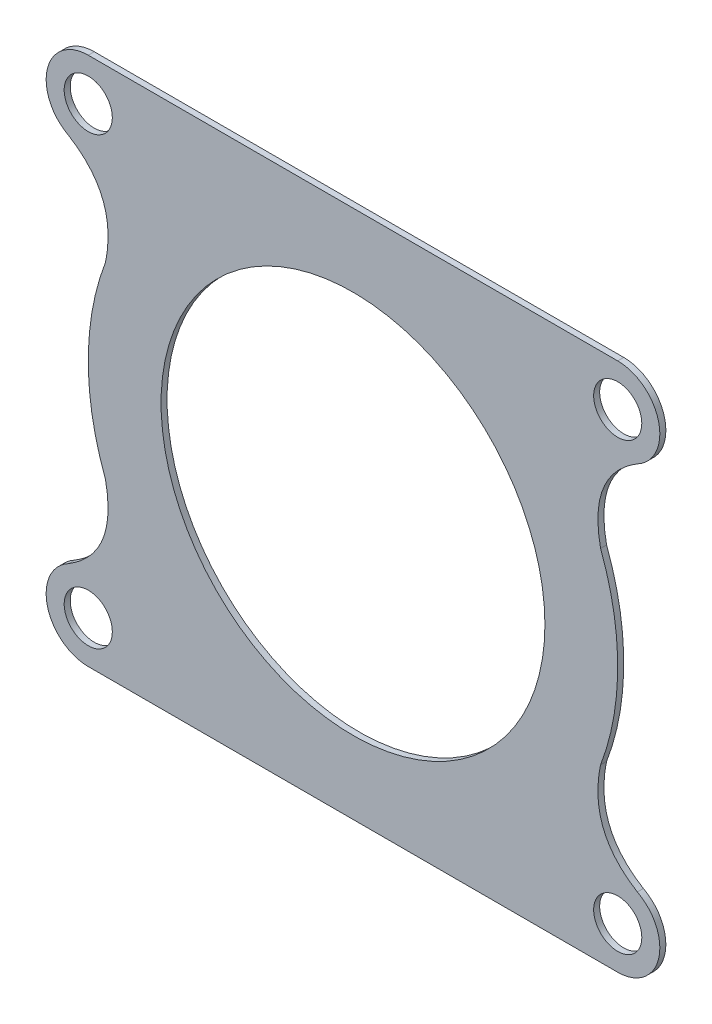
ISO-10303-21;
HEADER;
FILE_DESCRIPTION(('STEP AP214'),'2;1');
FILE_NAME('part.step','',(''),(''),'','','');
FILE_SCHEMA(('AUTOMOTIVE_DESIGN { 1 0 10303 214 1 1 1 1 }'));
ENDSEC;
DATA;
#1=APPLICATION_CONTEXT('core data for automotive mechanical design processes');
#2=APPLICATION_PROTOCOL_DEFINITION('international standard','automotive_design',2000,#1);
#3=PRODUCT_CONTEXT('',#1,'mechanical');
#4=PRODUCT('Part','Part','',(#3));
#5=PRODUCT_RELATED_PRODUCT_CATEGORY('part','',(#4));
#6=PRODUCT_DEFINITION_FORMATION('','',#4);
#7=PRODUCT_DEFINITION_CONTEXT('part definition',#1,'design');
#8=PRODUCT_DEFINITION('design','',#6,#7);
#9=PRODUCT_DEFINITION_SHAPE('','',#8);
#10=(LENGTH_UNIT() NAMED_UNIT(*) SI_UNIT(.MILLI.,.METRE.));
#11=(NAMED_UNIT(*) PLANE_ANGLE_UNIT() SI_UNIT($,.RADIAN.));
#12=(NAMED_UNIT(*) SI_UNIT($,.STERADIAN.) SOLID_ANGLE_UNIT());
#13=UNCERTAINTY_MEASURE_WITH_UNIT(LENGTH_MEASURE(1.E-05),#10,'distance_accuracy_value','');
#14=(GEOMETRIC_REPRESENTATION_CONTEXT(3) GLOBAL_UNCERTAINTY_ASSIGNED_CONTEXT((#13)) GLOBAL_UNIT_ASSIGNED_CONTEXT((#10,
#11,#12)) REPRESENTATION_CONTEXT('',''));
#15=CARTESIAN_POINT('',(0.,0.,0.));
#16=DIRECTION('',(0.,0.,1.));
#17=DIRECTION('',(1.,0.,0.));
#18=AXIS2_PLACEMENT_3D('',#15,#16,#17);
#19=CARTESIAN_POINT('',(-10.9904908296099,9.65088660433989,0.25));
#20=DIRECTION('',(0.,0.,1.));
#21=DIRECTION('',(1.,0.,0.));
#22=AXIS2_PLACEMENT_3D('',#19,#20,#21);
#23=PLANE('',#22);
#24=CARTESIAN_POINT('',(-10.9904908296099,-8.84911339566011,0.25));
#25=DIRECTION('',(0.,0.,1.));
#26=DIRECTION('',(1.,0.,0.));
#27=AXIS2_PLACEMENT_3D('',#24,#25,#26);
#28=CIRCLE('',#27,0.999999999999998);
#29=CARTESIAN_POINT('',(-9.9904908296099,-8.84911339566011,0.25));
#30=VERTEX_POINT('',#29);
#31=EDGE_CURVE('E513',#30,#30,#28,.T.);
#32=ORIENTED_EDGE('',*,*,#31,.F.);
#33=EDGE_LOOP('',(#32));
#34=FACE_BOUND('',#33,.T.);
#35=CARTESIAN_POINT('',(-10.9904908296099,9.65088660433989,0.25));
#36=DIRECTION('',(0.,0.,1.));
#37=DIRECTION('',(1.,0.,0.));
#38=AXIS2_PLACEMENT_3D('',#35,#36,#37);
#39=CIRCLE('',#38,1.);
#40=CARTESIAN_POINT('',(-9.9904908296099,9.65088660433989,0.25));
#41=VERTEX_POINT('',#40);
#42=EDGE_CURVE('E529',#41,#41,#39,.T.);
#43=ORIENTED_EDGE('',*,*,#42,.F.);
#44=EDGE_LOOP('',(#43));
#45=FACE_BOUND('',#44,.T.);
#46=CARTESIAN_POINT('',(-10.9904908296099,9.65088660433989,0.25));
#47=DIRECTION('',(0.,0.,1.));
#48=DIRECTION('',(1.,0.,0.));
#49=AXIS2_PLACEMENT_3D('',#46,#47,#48);
#50=CIRCLE('',#49,1.74999999999999);
#51=CARTESIAN_POINT('',(-10.9904908296099,11.4008866043399,0.25));
#52=VERTEX_POINT('',#51);
#53=CARTESIAN_POINT('',(-11.8060120475557,8.10252452029781,0.25));
#54=VERTEX_POINT('',#53);
#55=EDGE_CURVE('E223',#52,#54,#50,.T.);
#56=ORIENTED_EDGE('',*,*,#55,.T.);
#57=CARTESIAN_POINT('',(-896790.722122131,-442475.992951984,0.25));
#58=CARTESIAN_POINT('',(895703.111632128,444638.210990145,0.25));
#59=CARTESIAN_POINT('',(-894657.439231659,-446773.508022814,0.25));
#60=B_SPLINE_CURVE_WITH_KNOTS('',2,(#57,#58,#59),.UNSPECIFIED.,.F.,.F.,(3,3),(0.,1.),.UNSPECIFIED.);
#61=CARTESIAN_POINT('',(-10.2779050945684,4.29564047940197,0.25));
#62=VERTEX_POINT('',#61);
#63=EDGE_CURVE('E112',#54,#62,#60,.T.);
#64=ORIENTED_EDGE('',*,*,#63,.T.);
#65=CARTESIAN_POINT('',(0.00950917039010263,0.40088660433989,0.25));
#66=DIRECTION('',(0.,0.,1.));
#67=DIRECTION('',(1.,0.,0.));
#68=AXIS2_PLACEMENT_3D('',#65,#66,#67);
#69=CIRCLE('',#68,11.000000000281);
#70=CARTESIAN_POINT('',(-10.2779051012596,-3.49386724047607,0.25));
#71=VERTEX_POINT('',#70);
#72=EDGE_CURVE('E260',#62,#71,#69,.T.);
#73=ORIENTED_EDGE('',*,*,#72,.T.);
#74=CARTESIAN_POINT('',(-894657.439231684,446774.309795972,0.25));
#75=CARTESIAN_POINT('',(895703.11163213,-444637.409216931,0.25));
#76=CARTESIAN_POINT('',(-896790.722122111,442476.794725234,0.25));
#77=B_SPLINE_CURVE_WITH_KNOTS('',2,(#74,#75,#76),.UNSPECIFIED.,.F.,.F.,(3,3),(0.,1.),.UNSPECIFIED.);
#78=CARTESIAN_POINT('',(-11.8060120482112,-7.30075131204549,0.25));
#79=VERTEX_POINT('',#78);
#80=EDGE_CURVE('E280',#71,#79,#77,.T.);
#81=ORIENTED_EDGE('',*,*,#80,.T.);
#82=CARTESIAN_POINT('',(-10.9904908296099,-8.84911339566011,0.25));
#83=DIRECTION('',(0.,0.,1.));
#84=DIRECTION('',(1.,0.,0.));
#85=AXIS2_PLACEMENT_3D('',#82,#83,#84);
#86=CIRCLE('',#85,1.74999999998982);
#87=CARTESIAN_POINT('',(-10.9904908296099,-10.5991133956601,0.25));
#88=VERTEX_POINT('',#87);
#89=EDGE_CURVE('E276',#79,#88,#86,.T.);
#90=ORIENTED_EDGE('',*,*,#89,.T.);
#91=DIRECTION('',(1.,0.,0.));
#92=VECTOR('',#91,1.);
#93=CARTESIAN_POINT('',(-10.9904908296099,-10.5991133956601,0.25));
#94=LINE('',#93,#92);
#95=CARTESIAN_POINT('',(11.0095091703901,-10.5991133956601,0.25));
#96=VERTEX_POINT('',#95);
#97=EDGE_CURVE('E279',#88,#96,#94,.T.);
#98=ORIENTED_EDGE('',*,*,#97,.T.);
#99=CARTESIAN_POINT('',(11.0095091703901,-8.84911339566011,0.25));
#100=DIRECTION('',(0.,0.,1.));
#101=DIRECTION('',(1.,0.,0.));
#102=AXIS2_PLACEMENT_3D('',#99,#100,#101);
#103=CIRCLE('',#102,1.75);
#104=CARTESIAN_POINT('',(11.8250303883312,-7.30075131163249,0.25));
#105=VERTEX_POINT('',#104);
#106=EDGE_CURVE('E284',#96,#105,#103,.T.);
#107=ORIENTED_EDGE('',*,*,#106,.T.);
#108=CARTESIAN_POINT('',(896790.741140472,442476.794725193,0.25));
#109=CARTESIAN_POINT('',(-895703.092613789,-444637.409216932,0.25));
#110=CARTESIAN_POINT('',(894657.458250003,446774.309796016,0.25));
#111=B_SPLINE_CURVE_WITH_KNOTS('',2,(#108,#109,#110),.UNSPECIFIED.,.F.,.F.,(3,3),(0.,1.),.UNSPECIFIED.);
#112=CARTESIAN_POINT('',(10.296923435311,-3.49386727070898,0.25));
#113=VERTEX_POINT('',#112);
#114=EDGE_CURVE('E294',#105,#113,#111,.T.);
#115=ORIENTED_EDGE('',*,*,#114,.T.);
#116=CARTESIAN_POINT('',(0.00950917039010263,0.40088660433989,0.25));
#117=DIRECTION('',(0.,0.,1.));
#118=DIRECTION('',(1.,0.,0.));
#119=AXIS2_PLACEMENT_3D('',#116,#117,#118);
#120=CIRCLE('',#119,11.0000000002412);
#121=CARTESIAN_POINT('',(10.296923441853,4.29564044909903,0.25));
#122=VERTEX_POINT('',#121);
#123=EDGE_CURVE('E143',#113,#122,#120,.T.);
#124=ORIENTED_EDGE('',*,*,#123,.T.);
#125=CARTESIAN_POINT('',(894657.458250017,-446773.508022779,0.25));
#126=CARTESIAN_POINT('',(-895703.092613789,444638.210990142,0.25));
#127=CARTESIAN_POINT('',(896790.741140457,-442475.992952015,0.25));
#128=B_SPLINE_CURVE_WITH_KNOTS('',2,(#125,#126,#127),.UNSPECIFIED.,.F.,.F.,(3,3),(0.,1.),.UNSPECIFIED.);
#129=CARTESIAN_POINT('',(11.825030388974,8.10252452071291,0.25));
#130=VERTEX_POINT('',#129);
#131=EDGE_CURVE('E137',#122,#130,#128,.T.);
#132=ORIENTED_EDGE('',*,*,#131,.T.);
#133=CARTESIAN_POINT('',(11.0095091703901,9.65088660433989,0.25));
#134=DIRECTION('',(0.,0.,1.));
#135=DIRECTION('',(1.,0.,0.));
#136=AXIS2_PLACEMENT_3D('',#133,#134,#135);
#137=CIRCLE('',#136,1.74999999999266);
#138=CARTESIAN_POINT('',(11.0095091703901,11.4008866043399,0.25));
#139=VERTEX_POINT('',#138);
#140=EDGE_CURVE('E141',#130,#139,#137,.T.);
#141=ORIENTED_EDGE('',*,*,#140,.T.);
#142=DIRECTION('',(-1.,0.,0.));
#143=VECTOR('',#142,1.);
#144=CARTESIAN_POINT('',(11.0095091703901,11.4008866043399,0.25));
#145=LINE('',#144,#143);
#146=EDGE_CURVE('E57',#139,#52,#145,.T.);
#147=ORIENTED_EDGE('',*,*,#146,.T.);
#148=EDGE_LOOP('',(#56,#64,#73,#81,#90,#98,#107,#115,#124,#132,#141,#147));
#149=FACE_BOUND('',#148,.T.);
#150=CARTESIAN_POINT('',(11.0095091703901,9.65088660433989,0.25));
#151=DIRECTION('',(0.,0.,1.));
#152=DIRECTION('',(1.,0.,0.));
#153=AXIS2_PLACEMENT_3D('',#150,#151,#152);
#154=CIRCLE('',#153,1.);
#155=CARTESIAN_POINT('',(12.0095091703901,9.65088660433989,0.25));
#156=VERTEX_POINT('',#155);
#157=EDGE_CURVE('E173',#156,#156,#154,.T.);
#158=ORIENTED_EDGE('',*,*,#157,.F.);
#159=EDGE_LOOP('',(#158));
#160=FACE_BOUND('',#159,.T.);
#161=CARTESIAN_POINT('',(11.0095091703901,-8.84911339566011,0.25));
#162=DIRECTION('',(0.,0.,1.));
#163=DIRECTION('',(1.,0.,0.));
#164=AXIS2_PLACEMENT_3D('',#161,#162,#163);
#165=CIRCLE('',#164,0.999999999999999);
#166=CARTESIAN_POINT('',(12.0095091703901,-8.84911339566011,0.25));
#167=VERTEX_POINT('',#166);
#168=EDGE_CURVE('E521',#167,#167,#165,.T.);
#169=ORIENTED_EDGE('',*,*,#168,.F.);
#170=EDGE_LOOP('',(#169));
#171=FACE_BOUND('',#170,.T.);
#172=CARTESIAN_POINT('',(0.00950917039010263,0.40088660433989,0.25));
#173=DIRECTION('',(0.,0.,1.));
#174=DIRECTION('',(1.,0.,0.));
#175=AXIS2_PLACEMENT_3D('',#172,#173,#174);
#176=CIRCLE('',#175,7.975);
#177=CARTESIAN_POINT('',(7.9845091703901,0.40088660433989,0.25));
#178=VERTEX_POINT('',#177);
#179=EDGE_CURVE('E502',#178,#178,#176,.T.);
#180=ORIENTED_EDGE('',*,*,#179,.F.);
#181=EDGE_LOOP('',(#180));
#182=FACE_BOUND('',#181,.T.);
#183=ADVANCED_FACE('F39',(#34,#45,#149,#160,#171,#182),#23,.T.);
#184=CARTESIAN_POINT('',(-10.9904908296099,9.65088660433989,0.));
#185=DIRECTION('',(0.,0.,1.));
#186=DIRECTION('',(1.,0.,0.));
#187=AXIS2_PLACEMENT_3D('',#184,#185,#186);
#188=PLANE('',#187);
#189=CARTESIAN_POINT('',(-10.9904908296099,9.65088660433989,0.));
#190=DIRECTION('',(0.,0.,1.));
#191=DIRECTION('',(1.,0.,0.));
#192=AXIS2_PLACEMENT_3D('',#189,#190,#191);
#193=CIRCLE('',#192,1.74999999999999);
#194=CARTESIAN_POINT('',(-10.9904908296099,11.4008866043399,0.));
#195=VERTEX_POINT('',#194);
#196=CARTESIAN_POINT('',(-11.8060120475557,8.10252452029781,0.));
#197=VERTEX_POINT('',#196);
#198=EDGE_CURVE('E168',#195,#197,#193,.T.);
#199=ORIENTED_EDGE('',*,*,#198,.F.);
#200=DIRECTION('',(-1.,0.,0.));
#201=VECTOR('',#200,1.);
#202=CARTESIAN_POINT('',(11.0095091703901,11.4008866043399,0.));
#203=LINE('',#202,#201);
#204=CARTESIAN_POINT('',(11.0095091703901,11.4008866043399,0.));
#205=VERTEX_POINT('',#204);
#206=EDGE_CURVE('E104',#205,#195,#203,.T.);
#207=ORIENTED_EDGE('',*,*,#206,.F.);
#208=CARTESIAN_POINT('',(11.0095091703901,9.65088660433989,0.));
#209=DIRECTION('',(0.,0.,1.));
#210=DIRECTION('',(1.,0.,0.));
#211=AXIS2_PLACEMENT_3D('',#208,#209,#210);
#212=CIRCLE('',#211,1.74999999999266);
#213=CARTESIAN_POINT('',(11.825030388974,8.10252452071291,0.));
#214=VERTEX_POINT('',#213);
#215=EDGE_CURVE('E98',#214,#205,#212,.T.);
#216=ORIENTED_EDGE('',*,*,#215,.F.);
#217=CARTESIAN_POINT('',(894657.458250017,-446773.508022779,0.));
#218=CARTESIAN_POINT('',(-895703.092613789,444638.210990142,0.));
#219=CARTESIAN_POINT('',(896790.741140457,-442475.992952015,0.));
#220=B_SPLINE_CURVE_WITH_KNOTS('',2,(#217,#218,#219),.UNSPECIFIED.,.F.,.F.,(3,3),(0.,1.),.UNSPECIFIED.);
#221=CARTESIAN_POINT('',(10.296923441853,4.29564044909903,0.));
#222=VERTEX_POINT('',#221);
#223=EDGE_CURVE('E152',#222,#214,#220,.T.);
#224=ORIENTED_EDGE('',*,*,#223,.F.);
#225=CARTESIAN_POINT('',(0.00950917039010263,0.40088660433989,0.));
#226=DIRECTION('',(0.,0.,1.));
#227=DIRECTION('',(1.,0.,0.));
#228=AXIS2_PLACEMENT_3D('',#225,#226,#227);
#229=CIRCLE('',#228,11.0000000002412);
#230=CARTESIAN_POINT('',(10.296923435311,-3.49386727070898,0.));
#231=VERTEX_POINT('',#230);
#232=EDGE_CURVE('E206',#231,#222,#229,.T.);
#233=ORIENTED_EDGE('',*,*,#232,.F.);
#234=CARTESIAN_POINT('',(896790.741140472,442476.794725193,0.));
#235=CARTESIAN_POINT('',(-895703.092613789,-444637.409216932,0.));
#236=CARTESIAN_POINT('',(894657.458250003,446774.309796016,0.));
#237=B_SPLINE_CURVE_WITH_KNOTS('',2,(#234,#235,#236),.UNSPECIFIED.,.F.,.F.,(3,3),(0.,1.),.UNSPECIFIED.);
#238=CARTESIAN_POINT('',(11.8250303883312,-7.30075131163249,0.));
#239=VERTEX_POINT('',#238);
#240=EDGE_CURVE('E201',#239,#231,#237,.T.);
#241=ORIENTED_EDGE('',*,*,#240,.F.);
#242=CARTESIAN_POINT('',(11.0095091703901,-8.84911339566011,0.));
#243=DIRECTION('',(0.,0.,1.));
#244=DIRECTION('',(1.,0.,0.));
#245=AXIS2_PLACEMENT_3D('',#242,#243,#244);
#246=CIRCLE('',#245,1.75);
#247=CARTESIAN_POINT('',(11.0095091703901,-10.5991133956601,0.));
#248=VERTEX_POINT('',#247);
#249=EDGE_CURVE('E198',#248,#239,#246,.T.);
#250=ORIENTED_EDGE('',*,*,#249,.F.);
#251=DIRECTION('',(1.,0.,0.));
#252=VECTOR('',#251,1.);
#253=CARTESIAN_POINT('',(-10.9904908296099,-10.5991133956601,0.));
#254=LINE('',#253,#252);
#255=CARTESIAN_POINT('',(-10.9904908296099,-10.5991133956601,0.));
#256=VERTEX_POINT('',#255);
#257=EDGE_CURVE('E195',#256,#248,#254,.T.);
#258=ORIENTED_EDGE('',*,*,#257,.F.);
#259=CARTESIAN_POINT('',(-10.9904908296099,-8.84911339566011,0.));
#260=DIRECTION('',(0.,0.,1.));
#261=DIRECTION('',(1.,0.,0.));
#262=AXIS2_PLACEMENT_3D('',#259,#260,#261);
#263=CIRCLE('',#262,1.74999999998982);
#264=CARTESIAN_POINT('',(-11.8060120482112,-7.30075131204549,0.));
#265=VERTEX_POINT('',#264);
#266=EDGE_CURVE('E189',#265,#256,#263,.T.);
#267=ORIENTED_EDGE('',*,*,#266,.F.);
#268=CARTESIAN_POINT('',(-894657.439231684,446774.309795972,0.));
#269=CARTESIAN_POINT('',(895703.11163213,-444637.409216931,0.));
#270=CARTESIAN_POINT('',(-896790.722122111,442476.794725234,0.));
#271=B_SPLINE_CURVE_WITH_KNOTS('',2,(#268,#269,#270),.UNSPECIFIED.,.F.,.F.,(3,3),(0.,1.),.UNSPECIFIED.);
#272=CARTESIAN_POINT('',(-10.2779051012596,-3.49386724047607,0.));
#273=VERTEX_POINT('',#272);
#274=EDGE_CURVE('E184',#273,#265,#271,.T.);
#275=ORIENTED_EDGE('',*,*,#274,.F.);
#276=CARTESIAN_POINT('',(0.00950917039010263,0.40088660433989,0.));
#277=DIRECTION('',(0.,0.,1.));
#278=DIRECTION('',(1.,0.,0.));
#279=AXIS2_PLACEMENT_3D('',#276,#277,#278);
#280=CIRCLE('',#279,11.000000000281);
#281=CARTESIAN_POINT('',(-10.2779050945684,4.29564047940197,0.));
#282=VERTEX_POINT('',#281);
#283=EDGE_CURVE('E178',#282,#273,#280,.T.);
#284=ORIENTED_EDGE('',*,*,#283,.F.);
#285=CARTESIAN_POINT('',(-896790.722122131,-442475.992951984,0.));
#286=CARTESIAN_POINT('',(895703.111632128,444638.210990145,0.));
#287=CARTESIAN_POINT('',(-894657.439231659,-446773.508022814,0.));
#288=B_SPLINE_CURVE_WITH_KNOTS('',2,(#285,#286,#287),.UNSPECIFIED.,.F.,.F.,(3,3),(0.,1.),.UNSPECIFIED.);
#289=EDGE_CURVE('E172',#197,#282,#288,.T.);
#290=ORIENTED_EDGE('',*,*,#289,.F.);
#291=EDGE_LOOP('',(#199,#207,#216,#224,#233,#241,#250,#258,#267,#275,#284,#290));
#292=FACE_BOUND('',#291,.T.);
#293=CARTESIAN_POINT('',(11.0095091703901,9.65088660433989,0.));
#294=DIRECTION('',(0.,0.,1.));
#295=DIRECTION('',(1.,0.,0.));
#296=AXIS2_PLACEMENT_3D('',#293,#294,#295);
#297=CIRCLE('',#296,1.);
#298=CARTESIAN_POINT('',(12.0095091703901,9.65088660433989,0.));
#299=VERTEX_POINT('',#298);
#300=EDGE_CURVE('E533',#299,#299,#297,.T.);
#301=ORIENTED_EDGE('',*,*,#300,.T.);
#302=EDGE_LOOP('',(#301));
#303=FACE_BOUND('',#302,.T.);
#304=CARTESIAN_POINT('',(-10.9904908296099,9.65088660433989,0.));
#305=DIRECTION('',(0.,0.,1.));
#306=DIRECTION('',(1.,0.,0.));
#307=AXIS2_PLACEMENT_3D('',#304,#305,#306);
#308=CIRCLE('',#307,1.);
#309=CARTESIAN_POINT('',(-9.9904908296099,9.65088660433989,0.));
#310=VERTEX_POINT('',#309);
#311=EDGE_CURVE('E525',#310,#310,#308,.T.);
#312=ORIENTED_EDGE('',*,*,#311,.T.);
#313=EDGE_LOOP('',(#312));
#314=FACE_BOUND('',#313,.T.);
#315=CARTESIAN_POINT('',(11.0095091703901,-8.84911339566011,0.));
#316=DIRECTION('',(0.,0.,1.));
#317=DIRECTION('',(1.,0.,0.));
#318=AXIS2_PLACEMENT_3D('',#315,#316,#317);
#319=CIRCLE('',#318,0.999999999999999);
#320=CARTESIAN_POINT('',(12.0095091703901,-8.84911339566011,0.));
#321=VERTEX_POINT('',#320);
#322=EDGE_CURVE('E517',#321,#321,#319,.T.);
#323=ORIENTED_EDGE('',*,*,#322,.T.);
#324=EDGE_LOOP('',(#323));
#325=FACE_BOUND('',#324,.T.);
#326=CARTESIAN_POINT('',(-10.9904908296099,-8.84911339566011,0.));
#327=DIRECTION('',(0.,0.,1.));
#328=DIRECTION('',(1.,0.,0.));
#329=AXIS2_PLACEMENT_3D('',#326,#327,#328);
#330=CIRCLE('',#329,0.999999999999998);
#331=CARTESIAN_POINT('',(-9.9904908296099,-8.84911339566011,0.));
#332=VERTEX_POINT('',#331);
#333=EDGE_CURVE('E510',#332,#332,#330,.T.);
#334=ORIENTED_EDGE('',*,*,#333,.T.);
#335=EDGE_LOOP('',(#334));
#336=FACE_BOUND('',#335,.T.);
#337=CARTESIAN_POINT('',(0.00950917039010263,0.40088660433989,0.));
#338=DIRECTION('',(0.,0.,1.));
#339=DIRECTION('',(1.,0.,0.));
#340=AXIS2_PLACEMENT_3D('',#337,#338,#339);
#341=CIRCLE('',#340,7.975);
#342=CARTESIAN_POINT('',(7.9845091703901,0.40088660433989,0.));
#343=VERTEX_POINT('',#342);
#344=EDGE_CURVE('E505',#343,#343,#341,.T.);
#345=ORIENTED_EDGE('',*,*,#344,.T.);
#346=EDGE_LOOP('',(#345));
#347=FACE_BOUND('',#346,.T.);
#348=ADVANCED_FACE('F264',(#292,#303,#314,#325,#336,#347),#188,.F.);
#349=CARTESIAN_POINT('',(-10.9904908296099,9.65088660433989,0.25));
#350=DIRECTION('',(0.,0.,-1.));
#351=DIRECTION('',(-1.,0.,0.));
#352=AXIS2_PLACEMENT_3D('',#349,#350,#351);
#353=CYLINDRICAL_SURFACE('',#352,1.74999999999999);
#354=ORIENTED_EDGE('',*,*,#198,.T.);
#355=DIRECTION('',(0.,0.,-1.));
#356=VECTOR('',#355,1.);
#357=CARTESIAN_POINT('',(-11.8060120475557,8.10252452029781,0.25));
#358=LINE('',#357,#356);
#359=EDGE_CURVE('E11',#54,#197,#358,.T.);
#360=ORIENTED_EDGE('',*,*,#359,.F.);
#361=ORIENTED_EDGE('',*,*,#55,.F.);
#362=DIRECTION('',(0.,0.,-1.));
#363=VECTOR('',#362,1.);
#364=CARTESIAN_POINT('',(-10.9904908296099,11.4008866043399,0.25));
#365=LINE('',#364,#363);
#366=EDGE_CURVE('E161',#52,#195,#365,.T.);
#367=ORIENTED_EDGE('',*,*,#366,.T.);
#368=EDGE_LOOP('',(#354,#360,#361,#367));
#369=FACE_BOUND('',#368,.T.);
#370=ADVANCED_FACE('F41',(#369),#353,.T.);
#371=DIRECTION('',(0.,0.,-1.));
#372=VECTOR('',#371,1.);
#373=SURFACE_OF_LINEAR_EXTRUSION('',#60,#372);
#374=ORIENTED_EDGE('',*,*,#289,.T.);
#375=DIRECTION('',(0.,0.,-1.));
#376=VECTOR('',#375,1.);
#377=CARTESIAN_POINT('',(-10.2779050945684,4.29564047940197,0.25));
#378=LINE('',#377,#376);
#379=EDGE_CURVE('E49',#62,#282,#378,.T.);
#380=ORIENTED_EDGE('',*,*,#379,.F.);
#381=ORIENTED_EDGE('',*,*,#63,.F.);
#382=ORIENTED_EDGE('',*,*,#359,.T.);
#383=EDGE_LOOP('',(#374,#380,#381,#382));
#384=FACE_BOUND('',#383,.T.);
#385=ADVANCED_FACE('F323',(#384),#373,.F.);
#386=CARTESIAN_POINT('',(0.00950917039010263,0.40088660433989,0.25));
#387=DIRECTION('',(0.,0.,-1.));
#388=DIRECTION('',(-1.,0.,0.));
#389=AXIS2_PLACEMENT_3D('',#386,#387,#388);
#390=CYLINDRICAL_SURFACE('',#389,11.000000000281);
#391=ORIENTED_EDGE('',*,*,#283,.T.);
#392=DIRECTION('',(0.,0.,-1.));
#393=VECTOR('',#392,1.);
#394=CARTESIAN_POINT('',(-10.2779051012596,-3.49386724047607,0.25));
#395=LINE('',#394,#393);
#396=EDGE_CURVE('E250',#71,#273,#395,.T.);
#397=ORIENTED_EDGE('',*,*,#396,.F.);
#398=ORIENTED_EDGE('',*,*,#72,.F.);
#399=ORIENTED_EDGE('',*,*,#379,.T.);
#400=EDGE_LOOP('',(#391,#397,#398,#399));
#401=FACE_BOUND('',#400,.T.);
#402=ADVANCED_FACE('F258',(#401),#390,.T.);
#403=DIRECTION('',(0.,0.,-1.));
#404=VECTOR('',#403,1.);
#405=SURFACE_OF_LINEAR_EXTRUSION('',#77,#404);
#406=ORIENTED_EDGE('',*,*,#274,.T.);
#407=DIRECTION('',(0.,0.,-1.));
#408=VECTOR('',#407,1.);
#409=CARTESIAN_POINT('',(-11.8060120482112,-7.30075131204549,0.25));
#410=LINE('',#409,#408);
#411=EDGE_CURVE('E246',#79,#265,#410,.T.);
#412=ORIENTED_EDGE('',*,*,#411,.F.);
#413=ORIENTED_EDGE('',*,*,#80,.F.);
#414=ORIENTED_EDGE('',*,*,#396,.T.);
#415=EDGE_LOOP('',(#406,#412,#413,#414));
#416=FACE_BOUND('',#415,.T.);
#417=ADVANCED_FACE('F270',(#416),#405,.F.);
#418=CARTESIAN_POINT('',(-10.9904908296099,-8.84911339566011,0.25));
#419=DIRECTION('',(0.,0.,-1.));
#420=DIRECTION('',(-1.,0.,0.));
#421=AXIS2_PLACEMENT_3D('',#418,#419,#420);
#422=CYLINDRICAL_SURFACE('',#421,1.74999999998982);
#423=ORIENTED_EDGE('',*,*,#266,.T.);
#424=DIRECTION('',(0.,0.,-1.));
#425=VECTOR('',#424,1.);
#426=CARTESIAN_POINT('',(-10.9904908296099,-10.5991133956601,0.25));
#427=LINE('',#426,#425);
#428=EDGE_CURVE('E242',#88,#256,#427,.T.);
#429=ORIENTED_EDGE('',*,*,#428,.F.);
#430=ORIENTED_EDGE('',*,*,#89,.F.);
#431=ORIENTED_EDGE('',*,*,#411,.T.);
#432=EDGE_LOOP('',(#423,#429,#430,#431));
#433=FACE_BOUND('',#432,.T.);
#434=ADVANCED_FACE('F274',(#433),#422,.T.);
#435=CARTESIAN_POINT('',(-10.9904908296099,-10.5991133956601,0.25));
#436=DIRECTION('',(0.,1.,0.));
#437=DIRECTION('',(-1.,0.,0.));
#438=AXIS2_PLACEMENT_3D('',#435,#436,#437);
#439=PLANE('',#438);
#440=ORIENTED_EDGE('',*,*,#257,.T.);
#441=DIRECTION('',(0.,0.,-1.));
#442=VECTOR('',#441,1.);
#443=CARTESIAN_POINT('',(11.0095091703901,-10.5991133956601,0.25));
#444=LINE('',#443,#442);
#445=EDGE_CURVE('E238',#96,#248,#444,.T.);
#446=ORIENTED_EDGE('',*,*,#445,.F.);
#447=ORIENTED_EDGE('',*,*,#97,.F.);
#448=ORIENTED_EDGE('',*,*,#428,.T.);
#449=EDGE_LOOP('',(#440,#446,#447,#448));
#450=FACE_BOUND('',#449,.T.);
#451=ADVANCED_FACE('F313',(#450),#439,.F.);
#452=CARTESIAN_POINT('',(11.0095091703901,-8.84911339566011,0.25));
#453=DIRECTION('',(0.,0.,-1.));
#454=DIRECTION('',(-1.,0.,0.));
#455=AXIS2_PLACEMENT_3D('',#452,#453,#454);
#456=CYLINDRICAL_SURFACE('',#455,1.75);
#457=ORIENTED_EDGE('',*,*,#249,.T.);
#458=DIRECTION('',(0.,0.,-1.));
#459=VECTOR('',#458,1.);
#460=CARTESIAN_POINT('',(11.8250303883312,-7.30075131163249,0.25));
#461=LINE('',#460,#459);
#462=EDGE_CURVE('E234',#105,#239,#461,.T.);
#463=ORIENTED_EDGE('',*,*,#462,.F.);
#464=ORIENTED_EDGE('',*,*,#106,.F.);
#465=ORIENTED_EDGE('',*,*,#445,.T.);
#466=EDGE_LOOP('',(#457,#463,#464,#465));
#467=FACE_BOUND('',#466,.T.);
#468=ADVANCED_FACE('F308',(#467),#456,.T.);
#469=DIRECTION('',(0.,0.,-1.));
#470=VECTOR('',#469,1.);
#471=SURFACE_OF_LINEAR_EXTRUSION('',#111,#470);
#472=ORIENTED_EDGE('',*,*,#240,.T.);
#473=DIRECTION('',(0.,0.,-1.));
#474=VECTOR('',#473,1.);
#475=CARTESIAN_POINT('',(10.296923435311,-3.49386727070898,0.25));
#476=LINE('',#475,#474);
#477=EDGE_CURVE('E230',#113,#231,#476,.T.);
#478=ORIENTED_EDGE('',*,*,#477,.F.);
#479=ORIENTED_EDGE('',*,*,#114,.F.);
#480=ORIENTED_EDGE('',*,*,#462,.T.);
#481=EDGE_LOOP('',(#472,#478,#479,#480));
#482=FACE_BOUND('',#481,.T.);
#483=ADVANCED_FACE('F303',(#482),#471,.F.);
#484=CARTESIAN_POINT('',(0.00950917039010263,0.40088660433989,0.25));
#485=DIRECTION('',(0.,0.,-1.));
#486=DIRECTION('',(-1.,0.,0.));
#487=AXIS2_PLACEMENT_3D('',#484,#485,#486);
#488=CYLINDRICAL_SURFACE('',#487,11.0000000002412);
#489=ORIENTED_EDGE('',*,*,#232,.T.);
#490=DIRECTION('',(0.,0.,-1.));
#491=VECTOR('',#490,1.);
#492=CARTESIAN_POINT('',(10.296923441853,4.29564044909903,0.25));
#493=LINE('',#492,#491);
#494=EDGE_CURVE('E154',#122,#222,#493,.T.);
#495=ORIENTED_EDGE('',*,*,#494,.F.);
#496=ORIENTED_EDGE('',*,*,#123,.F.);
#497=ORIENTED_EDGE('',*,*,#477,.T.);
#498=EDGE_LOOP('',(#489,#495,#496,#497));
#499=FACE_BOUND('',#498,.T.);
#500=ADVANCED_FACE('F307',(#499),#488,.T.);
#501=DIRECTION('',(0.,0.,-1.));
#502=VECTOR('',#501,1.);
#503=SURFACE_OF_LINEAR_EXTRUSION('',#128,#502);
#504=ORIENTED_EDGE('',*,*,#223,.T.);
#505=DIRECTION('',(0.,0.,-1.));
#506=VECTOR('',#505,1.);
#507=CARTESIAN_POINT('',(11.825030388974,8.10252452071291,0.25));
#508=LINE('',#507,#506);
#509=EDGE_CURVE('E149',#130,#214,#508,.T.);
#510=ORIENTED_EDGE('',*,*,#509,.F.);
#511=ORIENTED_EDGE('',*,*,#131,.F.);
#512=ORIENTED_EDGE('',*,*,#494,.T.);
#513=EDGE_LOOP('',(#504,#510,#511,#512));
#514=FACE_BOUND('',#513,.T.);
#515=ADVANCED_FACE('F150',(#514),#503,.F.);
#516=CARTESIAN_POINT('',(11.0095091703901,9.65088660433989,0.25));
#517=DIRECTION('',(0.,0.,-1.));
#518=DIRECTION('',(-1.,0.,0.));
#519=AXIS2_PLACEMENT_3D('',#516,#517,#518);
#520=CYLINDRICAL_SURFACE('',#519,1.74999999999266);
#521=ORIENTED_EDGE('',*,*,#215,.T.);
#522=DIRECTION('',(0.,0.,-1.));
#523=VECTOR('',#522,1.);
#524=CARTESIAN_POINT('',(11.0095091703901,11.4008866043399,0.25));
#525=LINE('',#524,#523);
#526=EDGE_CURVE('E155',#139,#205,#525,.T.);
#527=ORIENTED_EDGE('',*,*,#526,.F.);
#528=ORIENTED_EDGE('',*,*,#140,.F.);
#529=ORIENTED_EDGE('',*,*,#509,.T.);
#530=EDGE_LOOP('',(#521,#527,#528,#529));
#531=FACE_BOUND('',#530,.T.);
#532=ADVANCED_FACE('F157',(#531),#520,.T.);
#533=CARTESIAN_POINT('',(11.0095091703901,11.4008866043399,0.25));
#534=DIRECTION('',(0.,-1.,0.));
#535=DIRECTION('',(1.,0.,0.));
#536=AXIS2_PLACEMENT_3D('',#533,#534,#535);
#537=PLANE('',#536);
#538=ORIENTED_EDGE('',*,*,#206,.T.);
#539=ORIENTED_EDGE('',*,*,#366,.F.);
#540=ORIENTED_EDGE('',*,*,#146,.F.);
#541=ORIENTED_EDGE('',*,*,#526,.T.);
#542=EDGE_LOOP('',(#538,#539,#540,#541));
#543=FACE_BOUND('',#542,.T.);
#544=ADVANCED_FACE('F367',(#543),#537,.F.);
#545=CARTESIAN_POINT('',(11.0095091703901,9.65088660433989,0.25));
#546=DIRECTION('',(0.,0.,-1.));
#547=DIRECTION('',(-1.,0.,0.));
#548=AXIS2_PLACEMENT_3D('',#545,#546,#547);
#549=CYLINDRICAL_SURFACE('',#548,1.);
#550=ORIENTED_EDGE('',*,*,#157,.T.);
#551=EDGE_LOOP('',(#550));
#552=FACE_BOUND('',#551,.T.);
#553=ORIENTED_EDGE('',*,*,#300,.F.);
#554=EDGE_LOOP('',(#553));
#555=FACE_BOUND('',#554,.T.);
#556=ADVANCED_FACE('F364',(#552,#555),#549,.F.);
#557=CARTESIAN_POINT('',(-10.9904908296099,9.65088660433989,0.25));
#558=DIRECTION('',(0.,0.,-1.));
#559=DIRECTION('',(-1.,0.,0.));
#560=AXIS2_PLACEMENT_3D('',#557,#558,#559);
#561=CYLINDRICAL_SURFACE('',#560,1.);
#562=ORIENTED_EDGE('',*,*,#42,.T.);
#563=EDGE_LOOP('',(#562));
#564=FACE_BOUND('',#563,.T.);
#565=ORIENTED_EDGE('',*,*,#311,.F.);
#566=EDGE_LOOP('',(#565));
#567=FACE_BOUND('',#566,.T.);
#568=ADVANCED_FACE('F385',(#564,#567),#561,.F.);
#569=CARTESIAN_POINT('',(11.0095091703901,-8.84911339566011,0.25));
#570=DIRECTION('',(0.,0.,-1.));
#571=DIRECTION('',(-1.,0.,0.));
#572=AXIS2_PLACEMENT_3D('',#569,#570,#571);
#573=CYLINDRICAL_SURFACE('',#572,0.999999999999999);
#574=ORIENTED_EDGE('',*,*,#168,.T.);
#575=EDGE_LOOP('',(#574));
#576=FACE_BOUND('',#575,.T.);
#577=ORIENTED_EDGE('',*,*,#322,.F.);
#578=EDGE_LOOP('',(#577));
#579=FACE_BOUND('',#578,.T.);
#580=ADVANCED_FACE('F392',(#576,#579),#573,.F.);
#581=CARTESIAN_POINT('',(-10.9904908296099,-8.84911339566011,0.25));
#582=DIRECTION('',(0.,0.,-1.));
#583=DIRECTION('',(-1.,0.,0.));
#584=AXIS2_PLACEMENT_3D('',#581,#582,#583);
#585=CYLINDRICAL_SURFACE('',#584,0.999999999999998);
#586=ORIENTED_EDGE('',*,*,#31,.T.);
#587=EDGE_LOOP('',(#586));
#588=FACE_BOUND('',#587,.T.);
#589=ORIENTED_EDGE('',*,*,#333,.F.);
#590=EDGE_LOOP('',(#589));
#591=FACE_BOUND('',#590,.T.);
#592=ADVANCED_FACE('F399',(#588,#591),#585,.F.);
#593=CARTESIAN_POINT('',(0.00950917039010263,0.40088660433989,0.25));
#594=DIRECTION('',(0.,0.,-1.));
#595=DIRECTION('',(-1.,0.,0.));
#596=AXIS2_PLACEMENT_3D('',#593,#594,#595);
#597=CYLINDRICAL_SURFACE('',#596,7.975);
#598=ORIENTED_EDGE('',*,*,#179,.T.);
#599=EDGE_LOOP('',(#598));
#600=FACE_BOUND('',#599,.T.);
#601=ORIENTED_EDGE('',*,*,#344,.F.);
#602=EDGE_LOOP('',(#601));
#603=FACE_BOUND('',#602,.T.);
#604=ADVANCED_FACE('F407',(#600,#603),#597,.F.);
#605=CLOSED_SHELL('',(#183,#348,#370,#385,#402,#417,#434,#451,#468,#483,#500,#515,#532,#544,
#556,#568,#580,#592,#604));
#606=MANIFOLD_SOLID_BREP('B2',#605);
#607=ADVANCED_BREP_SHAPE_REPRESENTATION('',(#18,#606),#14);
#608=SHAPE_DEFINITION_REPRESENTATION(#9,#607);
ENDSEC;
END-ISO-10303-21;
